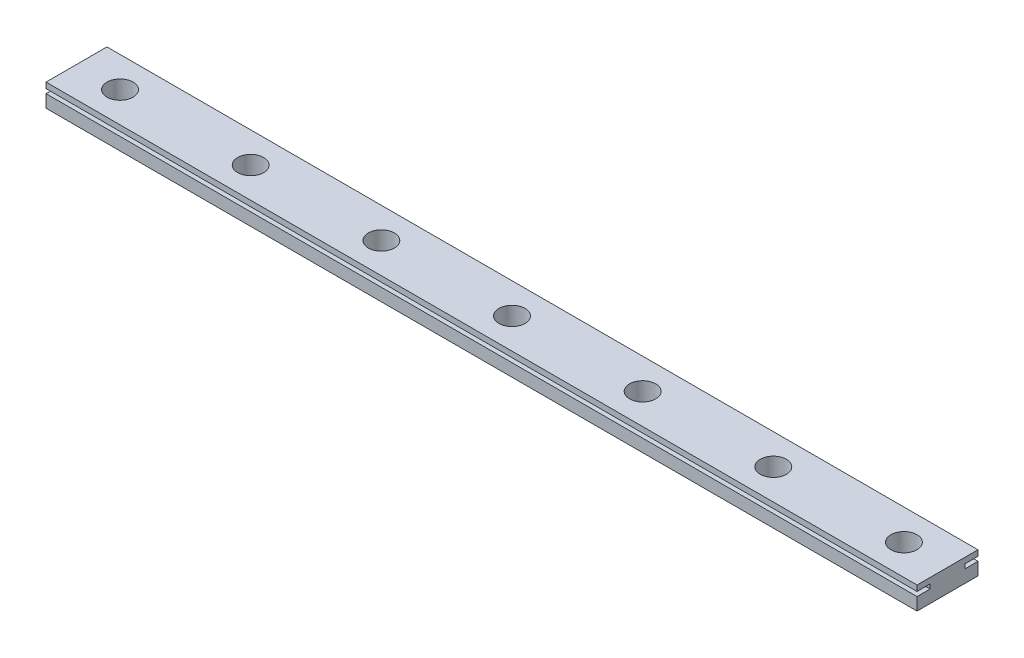
ISO-10303-21;
HEADER;
FILE_DESCRIPTION(('STEP AP214'),'2;1');
FILE_NAME('part.step','',(''),(''),'','','');
FILE_SCHEMA(('AUTOMOTIVE_DESIGN { 1 0 10303 214 1 1 1 1 }'));
ENDSEC;
DATA;
#1=APPLICATION_CONTEXT('core data for automotive mechanical design processes');
#2=APPLICATION_PROTOCOL_DEFINITION('international standard','automotive_design',2000,#1);
#3=PRODUCT_CONTEXT('',#1,'mechanical');
#4=PRODUCT('Part','Part','',(#3));
#5=PRODUCT_RELATED_PRODUCT_CATEGORY('part','',(#4));
#6=PRODUCT_DEFINITION_FORMATION('','',#4);
#7=PRODUCT_DEFINITION_CONTEXT('part definition',#1,'design');
#8=PRODUCT_DEFINITION('design','',#6,#7);
#9=PRODUCT_DEFINITION_SHAPE('','',#8);
#10=(LENGTH_UNIT() NAMED_UNIT(*) SI_UNIT(.MILLI.,.METRE.));
#11=(NAMED_UNIT(*) PLANE_ANGLE_UNIT() SI_UNIT($,.RADIAN.));
#12=(NAMED_UNIT(*) SI_UNIT($,.STERADIAN.) SOLID_ANGLE_UNIT());
#13=UNCERTAINTY_MEASURE_WITH_UNIT(LENGTH_MEASURE(1.E-05),#10,'distance_accuracy_value','');
#14=(GEOMETRIC_REPRESENTATION_CONTEXT(3) GLOBAL_UNCERTAINTY_ASSIGNED_CONTEXT((#13)) GLOBAL_UNIT_ASSIGNED_CONTEXT((#10,
#11,#12)) REPRESENTATION_CONTEXT('',''));
#15=CARTESIAN_POINT('',(0.,0.,0.));
#16=DIRECTION('',(0.,0.,1.));
#17=DIRECTION('',(1.,0.,0.));
#18=AXIS2_PLACEMENT_3D('',#15,#16,#17);
#19=CARTESIAN_POINT('',(190.,-25.8,-7.));
#20=DIRECTION('',(0.,1.,0.));
#21=DIRECTION('',(0.,0.,1.));
#22=AXIS2_PLACEMENT_3D('',#19,#20,#21);
#23=CYLINDRICAL_SURFACE('',#22,1.75);
#24=CARTESIAN_POINT('',(190.,0.,-7.));
#25=DIRECTION('',(0.,-1.,0.));
#26=DIRECTION('',(0.,0.,-1.));
#27=AXIS2_PLACEMENT_3D('',#24,#25,#26);
#28=CIRCLE('',#27,1.75);
#29=CARTESIAN_POINT('',(190.,0.,-8.75));
#30=VERTEX_POINT('',#29);
#31=EDGE_CURVE('E227',#30,#30,#28,.T.);
#32=ORIENTED_EDGE('',*,*,#31,.T.);
#33=EDGE_LOOP('',(#32));
#34=FACE_BOUND('',#33,.T.);
#35=CARTESIAN_POINT('',(190.,0.7,-7.));
#36=DIRECTION('',(0.,1.,0.));
#37=DIRECTION('',(0.,0.,1.));
#38=AXIS2_PLACEMENT_3D('',#35,#36,#37);
#39=CIRCLE('',#38,1.75);
#40=CARTESIAN_POINT('',(190.,0.7,-5.25));
#41=VERTEX_POINT('',#40);
#42=EDGE_CURVE('E659',#41,#41,#39,.T.);
#43=ORIENTED_EDGE('',*,*,#42,.T.);
#44=EDGE_LOOP('',(#43));
#45=FACE_BOUND('',#44,.T.);
#46=ADVANCED_FACE('F79',(#34,#45),#23,.F.);
#47=CARTESIAN_POINT('',(160.,-25.8,-7.));
#48=DIRECTION('',(0.,1.,0.));
#49=DIRECTION('',(0.,0.,1.));
#50=AXIS2_PLACEMENT_3D('',#47,#48,#49);
#51=CYLINDRICAL_SURFACE('',#50,1.75);
#52=CARTESIAN_POINT('',(160.,0.,-7.));
#53=DIRECTION('',(0.,-1.,0.));
#54=DIRECTION('',(0.,0.,-1.));
#55=AXIS2_PLACEMENT_3D('',#52,#53,#54);
#56=CIRCLE('',#55,1.75);
#57=CARTESIAN_POINT('',(160.,0.,-8.75));
#58=VERTEX_POINT('',#57);
#59=EDGE_CURVE('E230',#58,#58,#56,.T.);
#60=ORIENTED_EDGE('',*,*,#59,.T.);
#61=EDGE_LOOP('',(#60));
#62=FACE_BOUND('',#61,.T.);
#63=CARTESIAN_POINT('',(160.,0.7,-7.));
#64=DIRECTION('',(0.,1.,0.));
#65=DIRECTION('',(0.,0.,1.));
#66=AXIS2_PLACEMENT_3D('',#63,#64,#65);
#67=CIRCLE('',#66,1.75);
#68=CARTESIAN_POINT('',(160.,0.7,-5.25));
#69=VERTEX_POINT('',#68);
#70=EDGE_CURVE('E663',#69,#69,#67,.T.);
#71=ORIENTED_EDGE('',*,*,#70,.T.);
#72=EDGE_LOOP('',(#71));
#73=FACE_BOUND('',#72,.T.);
#74=ADVANCED_FACE('F320',(#62,#73),#51,.F.);
#75=CARTESIAN_POINT('',(130.,-25.8,-7.));
#76=DIRECTION('',(0.,1.,0.));
#77=DIRECTION('',(0.,0.,1.));
#78=AXIS2_PLACEMENT_3D('',#75,#76,#77);
#79=CYLINDRICAL_SURFACE('',#78,1.75);
#80=CARTESIAN_POINT('',(130.,0.,-7.));
#81=DIRECTION('',(0.,-1.,0.));
#82=DIRECTION('',(0.,0.,-1.));
#83=AXIS2_PLACEMENT_3D('',#80,#81,#82);
#84=CIRCLE('',#83,1.75);
#85=CARTESIAN_POINT('',(130.,0.,-8.75));
#86=VERTEX_POINT('',#85);
#87=EDGE_CURVE('E234',#86,#86,#84,.T.);
#88=ORIENTED_EDGE('',*,*,#87,.T.);
#89=EDGE_LOOP('',(#88));
#90=FACE_BOUND('',#89,.T.);
#91=CARTESIAN_POINT('',(130.,0.7,-7.));
#92=DIRECTION('',(0.,1.,0.));
#93=DIRECTION('',(0.,0.,1.));
#94=AXIS2_PLACEMENT_3D('',#91,#92,#93);
#95=CIRCLE('',#94,1.75);
#96=CARTESIAN_POINT('',(130.,0.7,-5.25));
#97=VERTEX_POINT('',#96);
#98=EDGE_CURVE('E674',#97,#97,#95,.T.);
#99=ORIENTED_EDGE('',*,*,#98,.T.);
#100=EDGE_LOOP('',(#99));
#101=FACE_BOUND('',#100,.T.);
#102=ADVANCED_FACE('F326',(#90,#101),#79,.F.);
#103=CARTESIAN_POINT('',(100.,-25.8,-7.));
#104=DIRECTION('',(0.,1.,0.));
#105=DIRECTION('',(0.,0.,1.));
#106=AXIS2_PLACEMENT_3D('',#103,#104,#105);
#107=CYLINDRICAL_SURFACE('',#106,1.75);
#108=CARTESIAN_POINT('',(100.,0.,-7.));
#109=DIRECTION('',(0.,-1.,0.));
#110=DIRECTION('',(0.,0.,-1.));
#111=AXIS2_PLACEMENT_3D('',#108,#109,#110);
#112=CIRCLE('',#111,1.75);
#113=CARTESIAN_POINT('',(100.,0.,-8.75));
#114=VERTEX_POINT('',#113);
#115=EDGE_CURVE('E237',#114,#114,#112,.T.);
#116=ORIENTED_EDGE('',*,*,#115,.T.);
#117=EDGE_LOOP('',(#116));
#118=FACE_BOUND('',#117,.T.);
#119=CARTESIAN_POINT('',(100.,0.7,-7.));
#120=DIRECTION('',(0.,1.,0.));
#121=DIRECTION('',(0.,0.,1.));
#122=AXIS2_PLACEMENT_3D('',#119,#120,#121);
#123=CIRCLE('',#122,1.75);
#124=CARTESIAN_POINT('',(100.,0.7,-5.25));
#125=VERTEX_POINT('',#124);
#126=EDGE_CURVE('E682',#125,#125,#123,.T.);
#127=ORIENTED_EDGE('',*,*,#126,.T.);
#128=EDGE_LOOP('',(#127));
#129=FACE_BOUND('',#128,.T.);
#130=ADVANCED_FACE('F493',(#118,#129),#107,.F.);
#131=CARTESIAN_POINT('',(70.,-25.8,-7.));
#132=DIRECTION('',(0.,1.,0.));
#133=DIRECTION('',(0.,0.,1.));
#134=AXIS2_PLACEMENT_3D('',#131,#132,#133);
#135=CYLINDRICAL_SURFACE('',#134,1.75);
#136=CARTESIAN_POINT('',(70.,0.,-7.));
#137=DIRECTION('',(0.,-1.,0.));
#138=DIRECTION('',(0.,0.,-1.));
#139=AXIS2_PLACEMENT_3D('',#136,#137,#138);
#140=CIRCLE('',#139,1.75);
#141=CARTESIAN_POINT('',(70.,0.,-8.75));
#142=VERTEX_POINT('',#141);
#143=EDGE_CURVE('E239',#142,#142,#140,.T.);
#144=ORIENTED_EDGE('',*,*,#143,.T.);
#145=EDGE_LOOP('',(#144));
#146=FACE_BOUND('',#145,.T.);
#147=CARTESIAN_POINT('',(70.,0.7,-7.));
#148=DIRECTION('',(0.,1.,0.));
#149=DIRECTION('',(0.,0.,1.));
#150=AXIS2_PLACEMENT_3D('',#147,#148,#149);
#151=CIRCLE('',#150,1.75);
#152=CARTESIAN_POINT('',(70.,0.7,-5.25));
#153=VERTEX_POINT('',#152);
#154=EDGE_CURVE('E691',#153,#153,#151,.T.);
#155=ORIENTED_EDGE('',*,*,#154,.T.);
#156=EDGE_LOOP('',(#155));
#157=FACE_BOUND('',#156,.T.);
#158=ADVANCED_FACE('F502',(#146,#157),#135,.F.);
#159=CARTESIAN_POINT('',(40.,-25.8,-7.));
#160=DIRECTION('',(0.,1.,0.));
#161=DIRECTION('',(0.,0.,1.));
#162=AXIS2_PLACEMENT_3D('',#159,#160,#161);
#163=CYLINDRICAL_SURFACE('',#162,1.75);
#164=CARTESIAN_POINT('',(40.,0.,-7.));
#165=DIRECTION('',(0.,-1.,0.));
#166=DIRECTION('',(0.,0.,-1.));
#167=AXIS2_PLACEMENT_3D('',#164,#165,#166);
#168=CIRCLE('',#167,1.75);
#169=CARTESIAN_POINT('',(40.,0.,-8.75));
#170=VERTEX_POINT('',#169);
#171=EDGE_CURVE('E83',#170,#170,#168,.T.);
#172=ORIENTED_EDGE('',*,*,#171,.T.);
#173=EDGE_LOOP('',(#172));
#174=FACE_BOUND('',#173,.T.);
#175=CARTESIAN_POINT('',(40.,0.7,-7.));
#176=DIRECTION('',(0.,1.,0.));
#177=DIRECTION('',(0.,0.,1.));
#178=AXIS2_PLACEMENT_3D('',#175,#176,#177);
#179=CIRCLE('',#178,1.75);
#180=CARTESIAN_POINT('',(40.,0.7,-5.25));
#181=VERTEX_POINT('',#180);
#182=EDGE_CURVE('E700',#181,#181,#179,.T.);
#183=ORIENTED_EDGE('',*,*,#182,.T.);
#184=EDGE_LOOP('',(#183));
#185=FACE_BOUND('',#184,.T.);
#186=ADVANCED_FACE('F344',(#174,#185),#163,.F.);
#187=CARTESIAN_POINT('',(10.,-25.8,-7.));
#188=DIRECTION('',(0.,1.,0.));
#189=DIRECTION('',(0.,0.,1.));
#190=AXIS2_PLACEMENT_3D('',#187,#188,#189);
#191=CYLINDRICAL_SURFACE('',#190,1.75);
#192=CARTESIAN_POINT('',(10.,0.,-7.));
#193=DIRECTION('',(0.,-1.,0.));
#194=DIRECTION('',(0.,0.,-1.));
#195=AXIS2_PLACEMENT_3D('',#192,#193,#194);
#196=CIRCLE('',#195,1.75);
#197=CARTESIAN_POINT('',(10.,0.,-8.75));
#198=VERTEX_POINT('',#197);
#199=EDGE_CURVE('E222',#198,#198,#196,.T.);
#200=ORIENTED_EDGE('',*,*,#199,.T.);
#201=EDGE_LOOP('',(#200));
#202=FACE_BOUND('',#201,.T.);
#203=CARTESIAN_POINT('',(10.,0.7,-7.));
#204=DIRECTION('',(0.,1.,0.));
#205=DIRECTION('',(0.,0.,1.));
#206=AXIS2_PLACEMENT_3D('',#203,#204,#205);
#207=CIRCLE('',#206,1.75);
#208=CARTESIAN_POINT('',(10.,0.7,-5.25));
#209=VERTEX_POINT('',#208);
#210=EDGE_CURVE('E244',#209,#209,#207,.T.);
#211=ORIENTED_EDGE('',*,*,#210,.T.);
#212=EDGE_LOOP('',(#211));
#213=FACE_BOUND('',#212,.T.);
#214=ADVANCED_FACE('F317',(#202,#213),#191,.F.);
#215=CARTESIAN_POINT('',(0.,5.2,0.));
#216=DIRECTION('',(0.,0.,-1.));
#217=DIRECTION('',(-1.,0.,0.));
#218=AXIS2_PLACEMENT_3D('',#215,#216,#217);
#219=PLANE('',#218);
#220=DIRECTION('',(0.,-1.,0.));
#221=VECTOR('',#220,1.);
#222=CARTESIAN_POINT('',(0.,5.2,0.));
#223=LINE('',#222,#221);
#224=CARTESIAN_POINT('',(0.,5.2,0.));
#225=VERTEX_POINT('',#224);
#226=CARTESIAN_POINT('',(0.,3.9,0.));
#227=VERTEX_POINT('',#226);
#228=EDGE_CURVE('E178',#225,#227,#223,.T.);
#229=ORIENTED_EDGE('',*,*,#228,.T.);
#230=DIRECTION('',(-1.,0.,0.));
#231=VECTOR('',#230,1.);
#232=CARTESIAN_POINT('',(210.,3.9,0.));
#233=LINE('',#232,#231);
#234=CARTESIAN_POINT('',(200.,3.9,0.));
#235=VERTEX_POINT('',#234);
#236=EDGE_CURVE('E276',#235,#227,#233,.T.);
#237=ORIENTED_EDGE('',*,*,#236,.F.);
#238=DIRECTION('',(0.,-1.,0.));
#239=VECTOR('',#238,1.);
#240=CARTESIAN_POINT('',(200.,5.2,0.));
#241=LINE('',#240,#239);
#242=CARTESIAN_POINT('',(200.,5.2,0.));
#243=VERTEX_POINT('',#242);
#244=EDGE_CURVE('E207',#243,#235,#241,.T.);
#245=ORIENTED_EDGE('',*,*,#244,.F.);
#246=DIRECTION('',(1.,0.,0.));
#247=VECTOR('',#246,1.);
#248=CARTESIAN_POINT('',(0.,5.2,0.));
#249=LINE('',#248,#247);
#250=EDGE_CURVE('E288',#225,#243,#249,.T.);
#251=ORIENTED_EDGE('',*,*,#250,.F.);
#252=EDGE_LOOP('',(#229,#237,#245,#251));
#253=FACE_BOUND('',#252,.T.);
#254=ADVANCED_FACE('F309',(#253),#219,.F.);
#255=CARTESIAN_POINT('',(0.,5.2,-14.));
#256=DIRECTION('',(0.,0.,1.));
#257=DIRECTION('',(1.,0.,0.));
#258=AXIS2_PLACEMENT_3D('',#255,#256,#257);
#259=PLANE('',#258);
#260=DIRECTION('',(0.,-1.,0.));
#261=VECTOR('',#260,1.);
#262=CARTESIAN_POINT('',(200.,5.2,-14.));
#263=LINE('',#262,#261);
#264=CARTESIAN_POINT('',(200.,5.2,-14.));
#265=VERTEX_POINT('',#264);
#266=CARTESIAN_POINT('',(200.,3.9,-14.));
#267=VERTEX_POINT('',#266);
#268=EDGE_CURVE('E203',#265,#267,#263,.T.);
#269=ORIENTED_EDGE('',*,*,#268,.T.);
#270=DIRECTION('',(-1.,0.,0.));
#271=VECTOR('',#270,1.);
#272=CARTESIAN_POINT('',(0.,3.9,-14.));
#273=LINE('',#272,#271);
#274=CARTESIAN_POINT('',(0.,3.9,-14.));
#275=VERTEX_POINT('',#274);
#276=EDGE_CURVE('E177',#267,#275,#273,.T.);
#277=ORIENTED_EDGE('',*,*,#276,.T.);
#278=DIRECTION('',(0.,-1.,0.));
#279=VECTOR('',#278,1.);
#280=CARTESIAN_POINT('',(0.,5.2,-14.));
#281=LINE('',#280,#279);
#282=CARTESIAN_POINT('',(0.,5.2,-14.));
#283=VERTEX_POINT('',#282);
#284=EDGE_CURVE('E194',#283,#275,#281,.T.);
#285=ORIENTED_EDGE('',*,*,#284,.F.);
#286=DIRECTION('',(-1.,0.,0.));
#287=VECTOR('',#286,1.);
#288=CARTESIAN_POINT('',(0.,5.2,-14.));
#289=LINE('',#288,#287);
#290=EDGE_CURVE('E195',#265,#283,#289,.T.);
#291=ORIENTED_EDGE('',*,*,#290,.F.);
#292=EDGE_LOOP('',(#269,#277,#285,#291));
#293=FACE_BOUND('',#292,.T.);
#294=ADVANCED_FACE('F315',(#293),#259,.F.);
#295=CARTESIAN_POINT('',(0.,5.2,0.));
#296=DIRECTION('',(1.,0.,0.));
#297=DIRECTION('',(0.,0.,-1.));
#298=AXIS2_PLACEMENT_3D('',#295,#296,#297);
#299=PLANE('',#298);
#300=ORIENTED_EDGE('',*,*,#284,.T.);
#301=DIRECTION('',(0.,0.,-1.));
#302=VECTOR('',#301,1.);
#303=CARTESIAN_POINT('',(0.,3.9,-11.));
#304=LINE('',#303,#302);
#305=CARTESIAN_POINT('',(0.,3.9,-11.));
#306=VERTEX_POINT('',#305);
#307=EDGE_CURVE('E261',#306,#275,#304,.T.);
#308=ORIENTED_EDGE('',*,*,#307,.F.);
#309=DIRECTION('',(0.,1.,0.));
#310=VECTOR('',#309,1.);
#311=CARTESIAN_POINT('',(0.,2.9,-11.));
#312=LINE('',#311,#310);
#313=CARTESIAN_POINT('',(0.,2.9,-11.));
#314=VERTEX_POINT('',#313);
#315=EDGE_CURVE('E187',#314,#306,#312,.T.);
#316=ORIENTED_EDGE('',*,*,#315,.F.);
#317=DIRECTION('',(0.,0.,1.));
#318=VECTOR('',#317,1.);
#319=CARTESIAN_POINT('',(0.,2.9,-14.));
#320=LINE('',#319,#318);
#321=CARTESIAN_POINT('',(0.,2.9,-14.));
#322=VERTEX_POINT('',#321);
#323=EDGE_CURVE('E172',#322,#314,#320,.T.);
#324=ORIENTED_EDGE('',*,*,#323,.F.);
#325=CARTESIAN_POINT('',(0.,0.,-14.));
#326=VERTEX_POINT('',#325);
#327=EDGE_CURVE('E183',#322,#326,#281,.T.);
#328=ORIENTED_EDGE('',*,*,#327,.T.);
#329=DIRECTION('',(0.,0.,1.));
#330=VECTOR('',#329,1.);
#331=CARTESIAN_POINT('',(0.,0.,0.));
#332=LINE('',#331,#330);
#333=CARTESIAN_POINT('',(0.,0.,0.));
#334=VERTEX_POINT('',#333);
#335=EDGE_CURVE('E284',#326,#334,#332,.T.);
#336=ORIENTED_EDGE('',*,*,#335,.T.);
#337=CARTESIAN_POINT('',(0.,2.9,0.));
#338=VERTEX_POINT('',#337);
#339=EDGE_CURVE('E210',#338,#334,#223,.T.);
#340=ORIENTED_EDGE('',*,*,#339,.F.);
#341=DIRECTION('',(0.,0.,1.));
#342=VECTOR('',#341,1.);
#343=CARTESIAN_POINT('',(0.,2.9,0.));
#344=LINE('',#343,#342);
#345=CARTESIAN_POINT('',(0.,2.9,-3.));
#346=VERTEX_POINT('',#345);
#347=EDGE_CURVE('E269',#346,#338,#344,.T.);
#348=ORIENTED_EDGE('',*,*,#347,.F.);
#349=DIRECTION('',(0.,-1.,0.));
#350=VECTOR('',#349,1.);
#351=CARTESIAN_POINT('',(0.,2.9,-3.));
#352=LINE('',#351,#350);
#353=CARTESIAN_POINT('',(0.,3.9,-3.));
#354=VERTEX_POINT('',#353);
#355=EDGE_CURVE('E225',#354,#346,#352,.T.);
#356=ORIENTED_EDGE('',*,*,#355,.F.);
#357=DIRECTION('',(0.,0.,-1.));
#358=VECTOR('',#357,1.);
#359=CARTESIAN_POINT('',(0.,3.9,-3.));
#360=LINE('',#359,#358);
#361=EDGE_CURVE('E271',#227,#354,#360,.T.);
#362=ORIENTED_EDGE('',*,*,#361,.F.);
#363=ORIENTED_EDGE('',*,*,#228,.F.);
#364=DIRECTION('',(0.,0.,1.));
#365=VECTOR('',#364,1.);
#366=CARTESIAN_POINT('',(0.,5.2,0.));
#367=LINE('',#366,#365);
#368=EDGE_CURVE('E285',#283,#225,#367,.T.);
#369=ORIENTED_EDGE('',*,*,#368,.F.);
#370=EDGE_LOOP('',(#300,#308,#316,#324,#328,#336,#340,#348,#356,#362,#363,#369));
#371=FACE_BOUND('',#370,.T.);
#372=ADVANCED_FACE('F81',(#371),#299,.F.);
#373=CARTESIAN_POINT('',(200.,2.9,0.));
#374=VERTEX_POINT('',#373);
#375=CARTESIAN_POINT('',(200.,0.,0.));
#376=VERTEX_POINT('',#375);
#377=EDGE_CURVE('E206',#374,#376,#241,.T.);
#378=ORIENTED_EDGE('',*,*,#377,.F.);
#379=DIRECTION('',(-1.,0.,0.));
#380=VECTOR('',#379,1.);
#381=CARTESIAN_POINT('',(210.,2.9,0.));
#382=LINE('',#381,#380);
#383=EDGE_CURVE('E96',#374,#338,#382,.T.);
#384=ORIENTED_EDGE('',*,*,#383,.T.);
#385=ORIENTED_EDGE('',*,*,#339,.T.);
#386=DIRECTION('',(1.,0.,0.));
#387=VECTOR('',#386,1.);
#388=CARTESIAN_POINT('',(0.,0.,0.));
#389=LINE('',#388,#387);
#390=EDGE_CURVE('E292',#334,#376,#389,.T.);
#391=ORIENTED_EDGE('',*,*,#390,.T.);
#392=EDGE_LOOP('',(#378,#384,#385,#391));
#393=FACE_BOUND('',#392,.T.);
#394=ADVANCED_FACE('F307',(#393),#219,.F.);
#395=CARTESIAN_POINT('',(200.,5.2,0.));
#396=DIRECTION('',(-1.,0.,0.));
#397=DIRECTION('',(0.,0.,1.));
#398=AXIS2_PLACEMENT_3D('',#395,#396,#397);
#399=PLANE('',#398);
#400=DIRECTION('',(0.,1.,0.));
#401=VECTOR('',#400,1.);
#402=CARTESIAN_POINT('',(200.,5.2,-11.));
#403=LINE('',#402,#401);
#404=CARTESIAN_POINT('',(200.,2.9,-11.));
#405=VERTEX_POINT('',#404);
#406=CARTESIAN_POINT('',(200.,3.9,-11.));
#407=VERTEX_POINT('',#406);
#408=EDGE_CURVE('E12',#405,#407,#403,.T.);
#409=ORIENTED_EDGE('',*,*,#408,.T.);
#410=DIRECTION('',(0.,0.,-1.));
#411=VECTOR('',#410,1.);
#412=CARTESIAN_POINT('',(200.,3.9,0.));
#413=LINE('',#412,#411);
#414=EDGE_CURVE('E281',#407,#267,#413,.T.);
#415=ORIENTED_EDGE('',*,*,#414,.T.);
#416=ORIENTED_EDGE('',*,*,#268,.F.);
#417=DIRECTION('',(0.,0.,-1.));
#418=VECTOR('',#417,1.);
#419=CARTESIAN_POINT('',(200.,5.2,0.));
#420=LINE('',#419,#418);
#421=EDGE_CURVE('E198',#243,#265,#420,.T.);
#422=ORIENTED_EDGE('',*,*,#421,.F.);
#423=ORIENTED_EDGE('',*,*,#244,.T.);
#424=DIRECTION('',(0.,0.,-1.));
#425=VECTOR('',#424,1.);
#426=CARTESIAN_POINT('',(200.,3.9,0.));
#427=LINE('',#426,#425);
#428=CARTESIAN_POINT('',(200.,3.9,-3.));
#429=VERTEX_POINT('',#428);
#430=EDGE_CURVE('E88',#235,#429,#427,.T.);
#431=ORIENTED_EDGE('',*,*,#430,.T.);
#432=DIRECTION('',(0.,-1.,0.));
#433=VECTOR('',#432,1.);
#434=CARTESIAN_POINT('',(200.,5.2,-3.));
#435=LINE('',#434,#433);
#436=CARTESIAN_POINT('',(200.,2.9,-3.));
#437=VERTEX_POINT('',#436);
#438=EDGE_CURVE('E217',#429,#437,#435,.T.);
#439=ORIENTED_EDGE('',*,*,#438,.T.);
#440=DIRECTION('',(0.,0.,1.));
#441=VECTOR('',#440,1.);
#442=CARTESIAN_POINT('',(200.,2.9,0.));
#443=LINE('',#442,#441);
#444=EDGE_CURVE('E215',#437,#374,#443,.T.);
#445=ORIENTED_EDGE('',*,*,#444,.T.);
#446=ORIENTED_EDGE('',*,*,#377,.T.);
#447=DIRECTION('',(0.,0.,-1.));
#448=VECTOR('',#447,1.);
#449=CARTESIAN_POINT('',(200.,0.,0.));
#450=LINE('',#449,#448);
#451=CARTESIAN_POINT('',(200.,0.,-14.));
#452=VERTEX_POINT('',#451);
#453=EDGE_CURVE('E294',#376,#452,#450,.T.);
#454=ORIENTED_EDGE('',*,*,#453,.T.);
#455=CARTESIAN_POINT('',(200.,2.9,-14.));
#456=VERTEX_POINT('',#455);
#457=EDGE_CURVE('E197',#456,#452,#263,.T.);
#458=ORIENTED_EDGE('',*,*,#457,.F.);
#459=DIRECTION('',(0.,0.,1.));
#460=VECTOR('',#459,1.);
#461=CARTESIAN_POINT('',(200.,2.9,0.));
#462=LINE('',#461,#460);
#463=EDGE_CURVE('E104',#456,#405,#462,.T.);
#464=ORIENTED_EDGE('',*,*,#463,.T.);
#465=EDGE_LOOP('',(#409,#415,#416,#422,#423,#431,#439,#445,#446,#454,#458,#464));
#466=FACE_BOUND('',#465,.T.);
#467=ADVANCED_FACE('F298',(#466),#399,.F.);
#468=ORIENTED_EDGE('',*,*,#327,.F.);
#469=DIRECTION('',(1.,0.,0.));
#470=VECTOR('',#469,1.);
#471=CARTESIAN_POINT('',(0.,2.9,-14.));
#472=LINE('',#471,#470);
#473=EDGE_CURVE('E169',#322,#456,#472,.T.);
#474=ORIENTED_EDGE('',*,*,#473,.T.);
#475=ORIENTED_EDGE('',*,*,#457,.T.);
#476=DIRECTION('',(-1.,0.,0.));
#477=VECTOR('',#476,1.);
#478=CARTESIAN_POINT('',(0.,0.,-14.));
#479=LINE('',#478,#477);
#480=EDGE_CURVE('E192',#452,#326,#479,.T.);
#481=ORIENTED_EDGE('',*,*,#480,.T.);
#482=EDGE_LOOP('',(#468,#474,#475,#481));
#483=FACE_BOUND('',#482,.T.);
#484=ADVANCED_FACE('F190',(#483),#259,.F.);
#485=CARTESIAN_POINT('',(0.,5.2,0.));
#486=DIRECTION('',(0.,-1.,0.));
#487=DIRECTION('',(0.,0.,-1.));
#488=AXIS2_PLACEMENT_3D('',#485,#486,#487);
#489=PLANE('',#488);
#490=CARTESIAN_POINT('',(40.,5.2,-7.));
#491=DIRECTION('',(0.,1.,0.));
#492=DIRECTION('',(0.,0.,1.));
#493=AXIS2_PLACEMENT_3D('',#490,#491,#492);
#494=CIRCLE('',#493,3.);
#495=CARTESIAN_POINT('',(40.,5.2,-4.));
#496=VERTEX_POINT('',#495);
#497=EDGE_CURVE('E703',#496,#496,#494,.T.);
#498=ORIENTED_EDGE('',*,*,#497,.F.);
#499=EDGE_LOOP('',(#498));
#500=FACE_BOUND('',#499,.T.);
#501=CARTESIAN_POINT('',(70.,5.2,-7.));
#502=DIRECTION('',(0.,1.,0.));
#503=DIRECTION('',(0.,0.,1.));
#504=AXIS2_PLACEMENT_3D('',#501,#502,#503);
#505=CIRCLE('',#504,3.);
#506=CARTESIAN_POINT('',(70.,5.2,-4.));
#507=VERTEX_POINT('',#506);
#508=EDGE_CURVE('E694',#507,#507,#505,.T.);
#509=ORIENTED_EDGE('',*,*,#508,.F.);
#510=EDGE_LOOP('',(#509));
#511=FACE_BOUND('',#510,.T.);
#512=CARTESIAN_POINT('',(100.,5.2,-7.));
#513=DIRECTION('',(0.,1.,0.));
#514=DIRECTION('',(0.,0.,1.));
#515=AXIS2_PLACEMENT_3D('',#512,#513,#514);
#516=CIRCLE('',#515,3.);
#517=CARTESIAN_POINT('',(100.,5.2,-4.));
#518=VERTEX_POINT('',#517);
#519=EDGE_CURVE('E685',#518,#518,#516,.T.);
#520=ORIENTED_EDGE('',*,*,#519,.F.);
#521=EDGE_LOOP('',(#520));
#522=FACE_BOUND('',#521,.T.);
#523=CARTESIAN_POINT('',(130.,5.2,-7.));
#524=DIRECTION('',(0.,1.,0.));
#525=DIRECTION('',(0.,0.,1.));
#526=AXIS2_PLACEMENT_3D('',#523,#524,#525);
#527=CIRCLE('',#526,3.);
#528=CARTESIAN_POINT('',(130.,5.2,-4.));
#529=VERTEX_POINT('',#528);
#530=EDGE_CURVE('E676',#529,#529,#527,.T.);
#531=ORIENTED_EDGE('',*,*,#530,.F.);
#532=EDGE_LOOP('',(#531));
#533=FACE_BOUND('',#532,.T.);
#534=CARTESIAN_POINT('',(160.,5.2,-7.));
#535=DIRECTION('',(0.,1.,0.));
#536=DIRECTION('',(0.,0.,1.));
#537=AXIS2_PLACEMENT_3D('',#534,#535,#536);
#538=CIRCLE('',#537,3.);
#539=CARTESIAN_POINT('',(160.,5.2,-4.));
#540=VERTEX_POINT('',#539);
#541=EDGE_CURVE('E665',#540,#540,#538,.T.);
#542=ORIENTED_EDGE('',*,*,#541,.F.);
#543=EDGE_LOOP('',(#542));
#544=FACE_BOUND('',#543,.T.);
#545=CARTESIAN_POINT('',(190.,5.2,-7.));
#546=DIRECTION('',(0.,1.,0.));
#547=DIRECTION('',(0.,0.,1.));
#548=AXIS2_PLACEMENT_3D('',#545,#546,#547);
#549=CIRCLE('',#548,3.);
#550=CARTESIAN_POINT('',(190.,5.2,-4.));
#551=VERTEX_POINT('',#550);
#552=EDGE_CURVE('E256',#551,#551,#549,.T.);
#553=ORIENTED_EDGE('',*,*,#552,.F.);
#554=EDGE_LOOP('',(#553));
#555=FACE_BOUND('',#554,.T.);
#556=CARTESIAN_POINT('',(10.,5.2,-7.));
#557=DIRECTION('',(0.,1.,0.));
#558=DIRECTION('',(0.,0.,1.));
#559=AXIS2_PLACEMENT_3D('',#556,#557,#558);
#560=CIRCLE('',#559,3.);
#561=CARTESIAN_POINT('',(10.,5.2,-4.));
#562=VERTEX_POINT('',#561);
#563=EDGE_CURVE('E248',#562,#562,#560,.T.);
#564=ORIENTED_EDGE('',*,*,#563,.F.);
#565=EDGE_LOOP('',(#564));
#566=FACE_BOUND('',#565,.T.);
#567=ORIENTED_EDGE('',*,*,#368,.T.);
#568=ORIENTED_EDGE('',*,*,#250,.T.);
#569=ORIENTED_EDGE('',*,*,#421,.T.);
#570=ORIENTED_EDGE('',*,*,#290,.T.);
#571=EDGE_LOOP('',(#567,#568,#569,#570));
#572=FACE_BOUND('',#571,.T.);
#573=ADVANCED_FACE('F366',(#500,#511,#522,#533,#544,#555,#566,#572),#489,.F.);
#574=CARTESIAN_POINT('',(0.,0.,0.));
#575=DIRECTION('',(0.,-1.,0.));
#576=DIRECTION('',(0.,0.,-1.));
#577=AXIS2_PLACEMENT_3D('',#574,#575,#576);
#578=PLANE('',#577);
#579=ORIENTED_EDGE('',*,*,#171,.F.);
#580=EDGE_LOOP('',(#579));
#581=FACE_BOUND('',#580,.T.);
#582=ORIENTED_EDGE('',*,*,#143,.F.);
#583=EDGE_LOOP('',(#582));
#584=FACE_BOUND('',#583,.T.);
#585=ORIENTED_EDGE('',*,*,#115,.F.);
#586=EDGE_LOOP('',(#585));
#587=FACE_BOUND('',#586,.T.);
#588=ORIENTED_EDGE('',*,*,#87,.F.);
#589=EDGE_LOOP('',(#588));
#590=FACE_BOUND('',#589,.T.);
#591=ORIENTED_EDGE('',*,*,#59,.F.);
#592=EDGE_LOOP('',(#591));
#593=FACE_BOUND('',#592,.T.);
#594=ORIENTED_EDGE('',*,*,#31,.F.);
#595=EDGE_LOOP('',(#594));
#596=FACE_BOUND('',#595,.T.);
#597=ORIENTED_EDGE('',*,*,#199,.F.);
#598=EDGE_LOOP('',(#597));
#599=FACE_BOUND('',#598,.T.);
#600=ORIENTED_EDGE('',*,*,#335,.F.);
#601=ORIENTED_EDGE('',*,*,#480,.F.);
#602=ORIENTED_EDGE('',*,*,#453,.F.);
#603=ORIENTED_EDGE('',*,*,#390,.F.);
#604=EDGE_LOOP('',(#600,#601,#602,#603));
#605=FACE_BOUND('',#604,.T.);
#606=ADVANCED_FACE('F302',(#581,#584,#587,#590,#593,#596,#599,#605),#578,.T.);
#607=CARTESIAN_POINT('',(210.,2.9,-11.));
#608=DIRECTION('',(0.,0.,1.));
#609=DIRECTION('',(1.,0.,0.));
#610=AXIS2_PLACEMENT_3D('',#607,#608,#609);
#611=PLANE('',#610);
#612=DIRECTION('',(-1.,0.,0.));
#613=VECTOR('',#612,1.);
#614=CARTESIAN_POINT('',(210.,2.9,-11.));
#615=LINE('',#614,#613);
#616=EDGE_CURVE('E263',#405,#314,#615,.T.);
#617=ORIENTED_EDGE('',*,*,#616,.T.);
#618=ORIENTED_EDGE('',*,*,#315,.T.);
#619=DIRECTION('',(-1.,0.,0.));
#620=VECTOR('',#619,1.);
#621=CARTESIAN_POINT('',(210.,3.9,-11.));
#622=LINE('',#621,#620);
#623=EDGE_CURVE('E264',#407,#306,#622,.T.);
#624=ORIENTED_EDGE('',*,*,#623,.F.);
#625=ORIENTED_EDGE('',*,*,#408,.F.);
#626=EDGE_LOOP('',(#617,#618,#624,#625));
#627=FACE_BOUND('',#626,.T.);
#628=ADVANCED_FACE('F349',(#627),#611,.F.);
#629=CARTESIAN_POINT('',(210.,3.9,-11.));
#630=DIRECTION('',(0.,1.,0.));
#631=DIRECTION('',(0.,0.,1.));
#632=AXIS2_PLACEMENT_3D('',#629,#630,#631);
#633=PLANE('',#632);
#634=ORIENTED_EDGE('',*,*,#623,.T.);
#635=ORIENTED_EDGE('',*,*,#307,.T.);
#636=ORIENTED_EDGE('',*,*,#276,.F.);
#637=ORIENTED_EDGE('',*,*,#414,.F.);
#638=EDGE_LOOP('',(#634,#635,#636,#637));
#639=FACE_BOUND('',#638,.T.);
#640=ADVANCED_FACE('F346',(#639),#633,.F.);
#641=CARTESIAN_POINT('',(210.,2.9,-14.));
#642=DIRECTION('',(0.,-1.,0.));
#643=DIRECTION('',(0.,0.,-1.));
#644=AXIS2_PLACEMENT_3D('',#641,#642,#643);
#645=PLANE('',#644);
#646=ORIENTED_EDGE('',*,*,#473,.F.);
#647=ORIENTED_EDGE('',*,*,#323,.T.);
#648=ORIENTED_EDGE('',*,*,#616,.F.);
#649=ORIENTED_EDGE('',*,*,#463,.F.);
#650=EDGE_LOOP('',(#646,#647,#648,#649));
#651=FACE_BOUND('',#650,.T.);
#652=ADVANCED_FACE('F171',(#651),#645,.F.);
#653=CARTESIAN_POINT('',(210.,2.9,-3.));
#654=DIRECTION('',(0.,0.,-1.));
#655=DIRECTION('',(-1.,0.,0.));
#656=AXIS2_PLACEMENT_3D('',#653,#654,#655);
#657=PLANE('',#656);
#658=DIRECTION('',(-1.,0.,0.));
#659=VECTOR('',#658,1.);
#660=CARTESIAN_POINT('',(210.,3.9,-3.));
#661=LINE('',#660,#659);
#662=EDGE_CURVE('E188',#429,#354,#661,.T.);
#663=ORIENTED_EDGE('',*,*,#662,.T.);
#664=ORIENTED_EDGE('',*,*,#355,.T.);
#665=DIRECTION('',(-1.,0.,0.));
#666=VECTOR('',#665,1.);
#667=CARTESIAN_POINT('',(210.,2.9,-3.));
#668=LINE('',#667,#666);
#669=EDGE_CURVE('E274',#437,#346,#668,.T.);
#670=ORIENTED_EDGE('',*,*,#669,.F.);
#671=ORIENTED_EDGE('',*,*,#438,.F.);
#672=EDGE_LOOP('',(#663,#664,#670,#671));
#673=FACE_BOUND('',#672,.T.);
#674=ADVANCED_FACE('F356',(#673),#657,.F.);
#675=CARTESIAN_POINT('',(210.,3.9,-3.));
#676=DIRECTION('',(0.,1.,0.));
#677=DIRECTION('',(0.,0.,1.));
#678=AXIS2_PLACEMENT_3D('',#675,#676,#677);
#679=PLANE('',#678);
#680=ORIENTED_EDGE('',*,*,#236,.T.);
#681=ORIENTED_EDGE('',*,*,#361,.T.);
#682=ORIENTED_EDGE('',*,*,#662,.F.);
#683=ORIENTED_EDGE('',*,*,#430,.F.);
#684=EDGE_LOOP('',(#680,#681,#682,#683));
#685=FACE_BOUND('',#684,.T.);
#686=ADVANCED_FACE('F357',(#685),#679,.F.);
#687=CARTESIAN_POINT('',(210.,2.9,0.));
#688=DIRECTION('',(0.,-1.,0.));
#689=DIRECTION('',(0.,0.,-1.));
#690=AXIS2_PLACEMENT_3D('',#687,#688,#689);
#691=PLANE('',#690);
#692=ORIENTED_EDGE('',*,*,#669,.T.);
#693=ORIENTED_EDGE('',*,*,#347,.T.);
#694=ORIENTED_EDGE('',*,*,#383,.F.);
#695=ORIENTED_EDGE('',*,*,#444,.F.);
#696=EDGE_LOOP('',(#692,#693,#694,#695));
#697=FACE_BOUND('',#696,.T.);
#698=ADVANCED_FACE('F340',(#697),#691,.F.);
#699=CARTESIAN_POINT('',(10.,0.7,-7.));
#700=DIRECTION('',(0.,1.,0.));
#701=DIRECTION('',(0.,0.,1.));
#702=AXIS2_PLACEMENT_3D('',#699,#700,#701);
#703=CYLINDRICAL_SURFACE('',#702,3.);
#704=CARTESIAN_POINT('',(10.,0.7,-7.));
#705=DIRECTION('',(0.,1.,0.));
#706=DIRECTION('',(0.,0.,1.));
#707=AXIS2_PLACEMENT_3D('',#704,#705,#706);
#708=CIRCLE('',#707,3.);
#709=CARTESIAN_POINT('',(10.,0.7,-4.));
#710=VERTEX_POINT('',#709);
#711=EDGE_CURVE('E226',#710,#710,#708,.T.);
#712=ORIENTED_EDGE('',*,*,#711,.F.);
#713=EDGE_LOOP('',(#712));
#714=FACE_BOUND('',#713,.T.);
#715=ORIENTED_EDGE('',*,*,#563,.T.);
#716=EDGE_LOOP('',(#715));
#717=FACE_BOUND('',#716,.T.);
#718=ADVANCED_FACE('F336',(#714,#717),#703,.F.);
#719=CARTESIAN_POINT('',(10.,0.7,-7.));
#720=DIRECTION('',(0.,1.,0.));
#721=DIRECTION('',(0.,0.,1.));
#722=AXIS2_PLACEMENT_3D('',#719,#720,#721);
#723=PLANE('',#722);
#724=ORIENTED_EDGE('',*,*,#210,.F.);
#725=EDGE_LOOP('',(#724));
#726=FACE_BOUND('',#725,.T.);
#727=ORIENTED_EDGE('',*,*,#711,.T.);
#728=EDGE_LOOP('',(#727));
#729=FACE_BOUND('',#728,.T.);
#730=ADVANCED_FACE('F332',(#726,#729),#723,.T.);
#731=CARTESIAN_POINT('',(40.,0.7,-7.));
#732=DIRECTION('',(0.,1.,0.));
#733=DIRECTION('',(0.,0.,1.));
#734=AXIS2_PLACEMENT_3D('',#731,#732,#733);
#735=CYLINDRICAL_SURFACE('',#734,3.);
#736=CARTESIAN_POINT('',(40.,0.7,-7.));
#737=DIRECTION('',(0.,1.,0.));
#738=DIRECTION('',(0.,0.,1.));
#739=AXIS2_PLACEMENT_3D('',#736,#737,#738);
#740=CIRCLE('',#739,3.);
#741=CARTESIAN_POINT('',(40.,0.7,-4.));
#742=VERTEX_POINT('',#741);
#743=EDGE_CURVE('E231',#742,#742,#740,.T.);
#744=ORIENTED_EDGE('',*,*,#743,.F.);
#745=EDGE_LOOP('',(#744));
#746=FACE_BOUND('',#745,.T.);
#747=ORIENTED_EDGE('',*,*,#497,.T.);
#748=EDGE_LOOP('',(#747));
#749=FACE_BOUND('',#748,.T.);
#750=ADVANCED_FACE('F335',(#746,#749),#735,.F.);
#751=CARTESIAN_POINT('',(40.,0.7,-7.));
#752=DIRECTION('',(0.,1.,0.));
#753=DIRECTION('',(0.,0.,1.));
#754=AXIS2_PLACEMENT_3D('',#751,#752,#753);
#755=PLANE('',#754);
#756=ORIENTED_EDGE('',*,*,#182,.F.);
#757=EDGE_LOOP('',(#756));
#758=FACE_BOUND('',#757,.T.);
#759=ORIENTED_EDGE('',*,*,#743,.T.);
#760=EDGE_LOOP('',(#759));
#761=FACE_BOUND('',#760,.T.);
#762=ADVANCED_FACE('F534',(#758,#761),#755,.T.);
#763=CARTESIAN_POINT('',(70.,0.7,-7.));
#764=DIRECTION('',(0.,1.,0.));
#765=DIRECTION('',(0.,0.,1.));
#766=AXIS2_PLACEMENT_3D('',#763,#764,#765);
#767=CYLINDRICAL_SURFACE('',#766,3.);
#768=CARTESIAN_POINT('',(70.,0.7,-7.));
#769=DIRECTION('',(0.,1.,0.));
#770=DIRECTION('',(0.,0.,1.));
#771=AXIS2_PLACEMENT_3D('',#768,#769,#770);
#772=CIRCLE('',#771,3.);
#773=CARTESIAN_POINT('',(70.,0.7,-4.));
#774=VERTEX_POINT('',#773);
#775=EDGE_CURVE('E697',#774,#774,#772,.T.);
#776=ORIENTED_EDGE('',*,*,#775,.F.);
#777=EDGE_LOOP('',(#776));
#778=FACE_BOUND('',#777,.T.);
#779=ORIENTED_EDGE('',*,*,#508,.T.);
#780=EDGE_LOOP('',(#779));
#781=FACE_BOUND('',#780,.T.);
#782=ADVANCED_FACE('F545',(#778,#781),#767,.F.);
#783=CARTESIAN_POINT('',(70.,0.7,-7.));
#784=DIRECTION('',(0.,1.,0.));
#785=DIRECTION('',(0.,0.,1.));
#786=AXIS2_PLACEMENT_3D('',#783,#784,#785);
#787=PLANE('',#786);
#788=ORIENTED_EDGE('',*,*,#154,.F.);
#789=EDGE_LOOP('',(#788));
#790=FACE_BOUND('',#789,.T.);
#791=ORIENTED_EDGE('',*,*,#775,.T.);
#792=EDGE_LOOP('',(#791));
#793=FACE_BOUND('',#792,.T.);
#794=ADVANCED_FACE('F555',(#790,#793),#787,.T.);
#795=CARTESIAN_POINT('',(100.,0.7,-7.));
#796=DIRECTION('',(0.,1.,0.));
#797=DIRECTION('',(0.,0.,1.));
#798=AXIS2_PLACEMENT_3D('',#795,#796,#797);
#799=CYLINDRICAL_SURFACE('',#798,3.);
#800=CARTESIAN_POINT('',(100.,0.7,-7.));
#801=DIRECTION('',(0.,1.,0.));
#802=DIRECTION('',(0.,0.,1.));
#803=AXIS2_PLACEMENT_3D('',#800,#801,#802);
#804=CIRCLE('',#803,3.);
#805=CARTESIAN_POINT('',(100.,0.7,-4.));
#806=VERTEX_POINT('',#805);
#807=EDGE_CURVE('E688',#806,#806,#804,.T.);
#808=ORIENTED_EDGE('',*,*,#807,.F.);
#809=EDGE_LOOP('',(#808));
#810=FACE_BOUND('',#809,.T.);
#811=ORIENTED_EDGE('',*,*,#519,.T.);
#812=EDGE_LOOP('',(#811));
#813=FACE_BOUND('',#812,.T.);
#814=ADVANCED_FACE('F566',(#810,#813),#799,.F.);
#815=CARTESIAN_POINT('',(100.,0.7,-7.));
#816=DIRECTION('',(0.,1.,0.));
#817=DIRECTION('',(0.,0.,1.));
#818=AXIS2_PLACEMENT_3D('',#815,#816,#817);
#819=PLANE('',#818);
#820=ORIENTED_EDGE('',*,*,#126,.F.);
#821=EDGE_LOOP('',(#820));
#822=FACE_BOUND('',#821,.T.);
#823=ORIENTED_EDGE('',*,*,#807,.T.);
#824=EDGE_LOOP('',(#823));
#825=FACE_BOUND('',#824,.T.);
#826=ADVANCED_FACE('F576',(#822,#825),#819,.T.);
#827=CARTESIAN_POINT('',(130.,0.7,-7.));
#828=DIRECTION('',(0.,1.,0.));
#829=DIRECTION('',(0.,0.,1.));
#830=AXIS2_PLACEMENT_3D('',#827,#828,#829);
#831=CYLINDRICAL_SURFACE('',#830,3.);
#832=CARTESIAN_POINT('',(130.,0.7,-7.));
#833=DIRECTION('',(0.,1.,0.));
#834=DIRECTION('',(0.,0.,1.));
#835=AXIS2_PLACEMENT_3D('',#832,#833,#834);
#836=CIRCLE('',#835,3.);
#837=CARTESIAN_POINT('',(130.,0.7,-4.));
#838=VERTEX_POINT('',#837);
#839=EDGE_CURVE('E679',#838,#838,#836,.T.);
#840=ORIENTED_EDGE('',*,*,#839,.F.);
#841=EDGE_LOOP('',(#840));
#842=FACE_BOUND('',#841,.T.);
#843=ORIENTED_EDGE('',*,*,#530,.T.);
#844=EDGE_LOOP('',(#843));
#845=FACE_BOUND('',#844,.T.);
#846=ADVANCED_FACE('F587',(#842,#845),#831,.F.);
#847=CARTESIAN_POINT('',(130.,0.7,-7.));
#848=DIRECTION('',(0.,1.,0.));
#849=DIRECTION('',(0.,0.,1.));
#850=AXIS2_PLACEMENT_3D('',#847,#848,#849);
#851=PLANE('',#850);
#852=ORIENTED_EDGE('',*,*,#98,.F.);
#853=EDGE_LOOP('',(#852));
#854=FACE_BOUND('',#853,.T.);
#855=ORIENTED_EDGE('',*,*,#839,.T.);
#856=EDGE_LOOP('',(#855));
#857=FACE_BOUND('',#856,.T.);
#858=ADVANCED_FACE('F597',(#854,#857),#851,.T.);
#859=CARTESIAN_POINT('',(160.,0.7,-7.));
#860=DIRECTION('',(0.,1.,0.));
#861=DIRECTION('',(0.,0.,1.));
#862=AXIS2_PLACEMENT_3D('',#859,#860,#861);
#863=CYLINDRICAL_SURFACE('',#862,3.);
#864=CARTESIAN_POINT('',(160.,0.7,-7.));
#865=DIRECTION('',(0.,1.,0.));
#866=DIRECTION('',(0.,0.,1.));
#867=AXIS2_PLACEMENT_3D('',#864,#865,#866);
#868=CIRCLE('',#867,3.);
#869=CARTESIAN_POINT('',(160.,0.7,-4.));
#870=VERTEX_POINT('',#869);
#871=EDGE_CURVE('E672',#870,#870,#868,.T.);
#872=ORIENTED_EDGE('',*,*,#871,.F.);
#873=EDGE_LOOP('',(#872));
#874=FACE_BOUND('',#873,.T.);
#875=ORIENTED_EDGE('',*,*,#541,.T.);
#876=EDGE_LOOP('',(#875));
#877=FACE_BOUND('',#876,.T.);
#878=ADVANCED_FACE('F608',(#874,#877),#863,.F.);
#879=CARTESIAN_POINT('',(160.,0.7,-7.));
#880=DIRECTION('',(0.,1.,0.));
#881=DIRECTION('',(0.,0.,1.));
#882=AXIS2_PLACEMENT_3D('',#879,#880,#881);
#883=PLANE('',#882);
#884=ORIENTED_EDGE('',*,*,#70,.F.);
#885=EDGE_LOOP('',(#884));
#886=FACE_BOUND('',#885,.T.);
#887=ORIENTED_EDGE('',*,*,#871,.T.);
#888=EDGE_LOOP('',(#887));
#889=FACE_BOUND('',#888,.T.);
#890=ADVANCED_FACE('F618',(#886,#889),#883,.T.);
#891=CARTESIAN_POINT('',(190.,0.7,-7.));
#892=DIRECTION('',(0.,1.,0.));
#893=DIRECTION('',(0.,0.,1.));
#894=AXIS2_PLACEMENT_3D('',#891,#892,#893);
#895=CYLINDRICAL_SURFACE('',#894,3.);
#896=CARTESIAN_POINT('',(190.,0.7,-7.));
#897=DIRECTION('',(0.,1.,0.));
#898=DIRECTION('',(0.,0.,1.));
#899=AXIS2_PLACEMENT_3D('',#896,#897,#898);
#900=CIRCLE('',#899,3.);
#901=CARTESIAN_POINT('',(190.,0.7,-4.));
#902=VERTEX_POINT('',#901);
#903=EDGE_CURVE('E662',#902,#902,#900,.T.);
#904=ORIENTED_EDGE('',*,*,#903,.F.);
#905=EDGE_LOOP('',(#904));
#906=FACE_BOUND('',#905,.T.);
#907=ORIENTED_EDGE('',*,*,#552,.T.);
#908=EDGE_LOOP('',(#907));
#909=FACE_BOUND('',#908,.T.);
#910=ADVANCED_FACE('F629',(#906,#909),#895,.F.);
#911=CARTESIAN_POINT('',(190.,0.7,-7.));
#912=DIRECTION('',(0.,1.,0.));
#913=DIRECTION('',(0.,0.,1.));
#914=AXIS2_PLACEMENT_3D('',#911,#912,#913);
#915=PLANE('',#914);
#916=ORIENTED_EDGE('',*,*,#42,.F.);
#917=EDGE_LOOP('',(#916));
#918=FACE_BOUND('',#917,.T.);
#919=ORIENTED_EDGE('',*,*,#903,.T.);
#920=EDGE_LOOP('',(#919));
#921=FACE_BOUND('',#920,.T.);
#922=ADVANCED_FACE('F639',(#918,#921),#915,.T.);
#923=CLOSED_SHELL('',(#46,#74,#102,#130,#158,#186,#214,#254,#294,#372,#394,#467,#484,#573,#606,
#628,#640,#652,#674,#686,#698,#718,#730,#750,#762,#782,#794,#814,#826,#846,#858,#878,#890,#910,#922));
#924=MANIFOLD_SOLID_BREP('B2',#923);
#925=ADVANCED_BREP_SHAPE_REPRESENTATION('',(#18,#924),#14);
#926=SHAPE_DEFINITION_REPRESENTATION(#9,#925);
ENDSEC;
END-ISO-10303-21;
